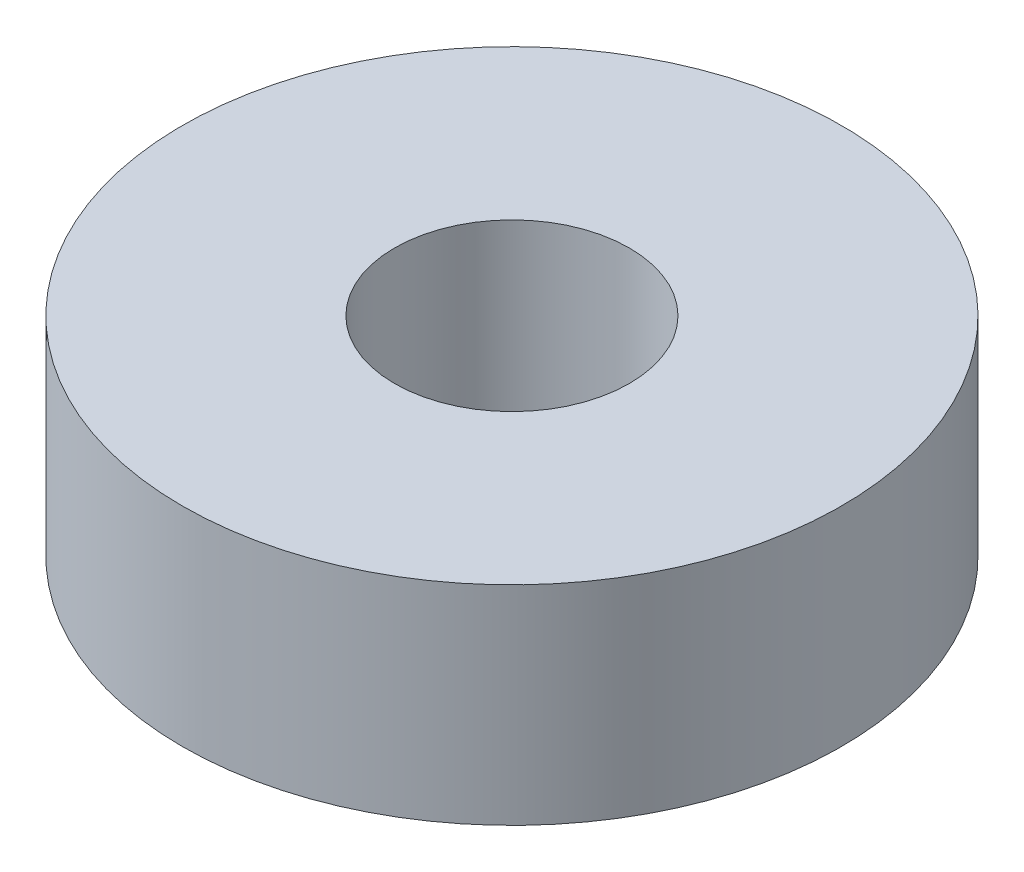
ISO-10303-21;
HEADER;
FILE_DESCRIPTION(('STEP AP214'),'2;1');
FILE_NAME('part.step','',(''),(''),'','','');
FILE_SCHEMA(('AUTOMOTIVE_DESIGN { 1 0 10303 214 1 1 1 1 }'));
ENDSEC;
DATA;
#1=APPLICATION_CONTEXT('core data for automotive mechanical design processes');
#2=APPLICATION_PROTOCOL_DEFINITION('international standard','automotive_design',2000,#1);
#3=PRODUCT_CONTEXT('',#1,'mechanical');
#4=PRODUCT('Part','Part','',(#3));
#5=PRODUCT_RELATED_PRODUCT_CATEGORY('part','',(#4));
#6=PRODUCT_DEFINITION_FORMATION('','',#4);
#7=PRODUCT_DEFINITION_CONTEXT('part definition',#1,'design');
#8=PRODUCT_DEFINITION('design','',#6,#7);
#9=PRODUCT_DEFINITION_SHAPE('','',#8);
#10=(LENGTH_UNIT() NAMED_UNIT(*) SI_UNIT(.MILLI.,.METRE.));
#11=(NAMED_UNIT(*) PLANE_ANGLE_UNIT() SI_UNIT($,.RADIAN.));
#12=(NAMED_UNIT(*) SI_UNIT($,.STERADIAN.) SOLID_ANGLE_UNIT());
#13=UNCERTAINTY_MEASURE_WITH_UNIT(LENGTH_MEASURE(1.E-05),#10,'distance_accuracy_value','');
#14=(GEOMETRIC_REPRESENTATION_CONTEXT(3) GLOBAL_UNCERTAINTY_ASSIGNED_CONTEXT((#13)) GLOBAL_UNIT_ASSIGNED_CONTEXT((#10,
#11,#12)) REPRESENTATION_CONTEXT('',''));
#15=CARTESIAN_POINT('',(0.,0.,0.));
#16=DIRECTION('',(0.,0.,1.));
#17=DIRECTION('',(1.,0.,0.));
#18=AXIS2_PLACEMENT_3D('',#15,#16,#17);
#19=CARTESIAN_POINT('',(0.,6.985,0.));
#20=DIRECTION('',(0.,1.,0.));
#21=DIRECTION('',(0.,0.,1.));
#22=AXIS2_PLACEMENT_3D('',#19,#20,#21);
#23=PLANE('',#22);
#24=CARTESIAN_POINT('',(0.,6.985,0.));
#25=DIRECTION('',(0.,1.,0.));
#26=DIRECTION('',(0.,0.,1.));
#27=AXIS2_PLACEMENT_3D('',#24,#25,#26);
#28=CIRCLE('',#27,11.049);
#29=CARTESIAN_POINT('',(0.,6.985,11.049));
#30=VERTEX_POINT('',#29);
#31=EDGE_CURVE('E10',#30,#30,#28,.T.);
#32=ORIENTED_EDGE('',*,*,#31,.T.);
#33=EDGE_LOOP('',(#32));
#34=FACE_BOUND('',#33,.T.);
#35=CARTESIAN_POINT('',(0.,6.985,0.));
#36=DIRECTION('',(0.,1.,0.));
#37=DIRECTION('',(0.,0.,1.));
#38=AXIS2_PLACEMENT_3D('',#35,#36,#37);
#39=CIRCLE('',#38,3.937);
#40=CARTESIAN_POINT('',(0.,6.985,3.937));
#41=VERTEX_POINT('',#40);
#42=EDGE_CURVE('E42',#41,#41,#39,.T.);
#43=ORIENTED_EDGE('',*,*,#42,.F.);
#44=EDGE_LOOP('',(#43));
#45=FACE_BOUND('',#44,.T.);
#46=ADVANCED_FACE('F31',(#34,#45),#23,.T.);
#47=CARTESIAN_POINT('',(0.,0.,0.));
#48=DIRECTION('',(0.,1.,0.));
#49=DIRECTION('',(0.,0.,1.));
#50=AXIS2_PLACEMENT_3D('',#47,#48,#49);
#51=PLANE('',#50);
#52=CARTESIAN_POINT('',(0.,0.,0.));
#53=DIRECTION('',(0.,1.,0.));
#54=DIRECTION('',(0.,0.,1.));
#55=AXIS2_PLACEMENT_3D('',#52,#53,#54);
#56=CIRCLE('',#55,11.049);
#57=CARTESIAN_POINT('',(0.,0.,11.049));
#58=VERTEX_POINT('',#57);
#59=EDGE_CURVE('E35',#58,#58,#56,.T.);
#60=ORIENTED_EDGE('',*,*,#59,.F.);
#61=EDGE_LOOP('',(#60));
#62=FACE_BOUND('',#61,.T.);
#63=CARTESIAN_POINT('',(0.,0.,0.));
#64=DIRECTION('',(0.,1.,0.));
#65=DIRECTION('',(0.,0.,1.));
#66=AXIS2_PLACEMENT_3D('',#63,#64,#65);
#67=CIRCLE('',#66,3.937);
#68=CARTESIAN_POINT('',(0.,0.,3.937));
#69=VERTEX_POINT('',#68);
#70=EDGE_CURVE('E44',#69,#69,#67,.T.);
#71=ORIENTED_EDGE('',*,*,#70,.T.);
#72=EDGE_LOOP('',(#71));
#73=FACE_BOUND('',#72,.T.);
#74=ADVANCED_FACE('F54',(#62,#73),#51,.F.);
#75=CARTESIAN_POINT('',(0.,6.985,0.));
#76=DIRECTION('',(0.,-1.,0.));
#77=DIRECTION('',(0.,0.,-1.));
#78=AXIS2_PLACEMENT_3D('',#75,#76,#77);
#79=CYLINDRICAL_SURFACE('',#78,11.049);
#80=ORIENTED_EDGE('',*,*,#31,.F.);
#81=EDGE_LOOP('',(#80));
#82=FACE_BOUND('',#81,.T.);
#83=ORIENTED_EDGE('',*,*,#59,.T.);
#84=EDGE_LOOP('',(#83));
#85=FACE_BOUND('',#84,.T.);
#86=ADVANCED_FACE('F33',(#82,#85),#79,.T.);
#87=CARTESIAN_POINT('',(0.,6.985,0.));
#88=DIRECTION('',(0.,-1.,0.));
#89=DIRECTION('',(0.,0.,-1.));
#90=AXIS2_PLACEMENT_3D('',#87,#88,#89);
#91=CYLINDRICAL_SURFACE('',#90,3.937);
#92=ORIENTED_EDGE('',*,*,#42,.T.);
#93=EDGE_LOOP('',(#92));
#94=FACE_BOUND('',#93,.T.);
#95=ORIENTED_EDGE('',*,*,#70,.F.);
#96=EDGE_LOOP('',(#95));
#97=FACE_BOUND('',#96,.T.);
#98=ADVANCED_FACE('F50',(#94,#97),#91,.F.);
#99=CLOSED_SHELL('',(#46,#74,#86,#98));
#100=MANIFOLD_SOLID_BREP('B2',#99);
#101=ADVANCED_BREP_SHAPE_REPRESENTATION('',(#18,#100),#14);
#102=SHAPE_DEFINITION_REPRESENTATION(#9,#101);
ENDSEC;
END-ISO-10303-21;
